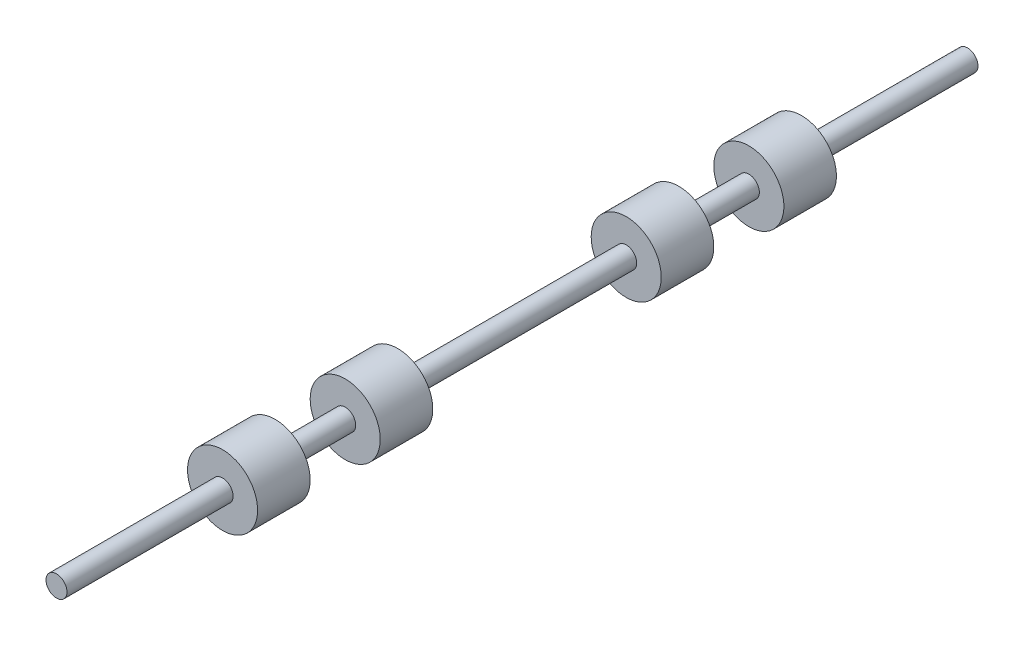
ISO-10303-21;
HEADER;
FILE_DESCRIPTION(('STEP AP214'),'2;1');
FILE_NAME('part.step','',(''),(''),'','','');
FILE_SCHEMA(('AUTOMOTIVE_DESIGN { 1 0 10303 214 1 1 1 1 }'));
ENDSEC;
DATA;
#1=APPLICATION_CONTEXT('core data for automotive mechanical design processes');
#2=APPLICATION_PROTOCOL_DEFINITION('international standard','automotive_design',2000,#1);
#3=PRODUCT_CONTEXT('',#1,'mechanical');
#4=PRODUCT('Part','Part','',(#3));
#5=PRODUCT_RELATED_PRODUCT_CATEGORY('part','',(#4));
#6=PRODUCT_DEFINITION_FORMATION('','',#4);
#7=PRODUCT_DEFINITION_CONTEXT('part definition',#1,'design');
#8=PRODUCT_DEFINITION('design','',#6,#7);
#9=PRODUCT_DEFINITION_SHAPE('','',#8);
#10=(LENGTH_UNIT() NAMED_UNIT(*) SI_UNIT(.MILLI.,.METRE.));
#11=(NAMED_UNIT(*) PLANE_ANGLE_UNIT() SI_UNIT($,.RADIAN.));
#12=(NAMED_UNIT(*) SI_UNIT($,.STERADIAN.) SOLID_ANGLE_UNIT());
#13=UNCERTAINTY_MEASURE_WITH_UNIT(LENGTH_MEASURE(1.E-05),#10,'distance_accuracy_value','');
#14=(GEOMETRIC_REPRESENTATION_CONTEXT(3) GLOBAL_UNCERTAINTY_ASSIGNED_CONTEXT((#13)) GLOBAL_UNIT_ASSIGNED_CONTEXT((#10,
#11,#12)) REPRESENTATION_CONTEXT('',''));
#15=CARTESIAN_POINT('',(0.,0.,0.));
#16=DIRECTION('',(0.,0.,1.));
#17=DIRECTION('',(1.,0.,0.));
#18=AXIS2_PLACEMENT_3D('',#15,#16,#17);
#19=CARTESIAN_POINT('',(0.,0.,16.26));
#20=DIRECTION('',(0.,0.,1.));
#21=DIRECTION('',(1.,0.,0.));
#22=AXIS2_PLACEMENT_3D('',#19,#20,#21);
#23=PLANE('',#22);
#24=CARTESIAN_POINT('',(0.,0.,16.26));
#25=DIRECTION('',(0.,0.,-1.));
#26=DIRECTION('',(-1.,0.,0.));
#27=AXIS2_PLACEMENT_3D('',#24,#25,#26);
#28=CIRCLE('',#27,1.);
#29=CARTESIAN_POINT('',(-1.,0.,16.26));
#30=VERTEX_POINT('',#29);
#31=EDGE_CURVE('E11',#30,#30,#28,.T.);
#32=ORIENTED_EDGE('',*,*,#31,.T.);
#33=EDGE_LOOP('',(#32));
#34=FACE_BOUND('',#33,.T.);
#35=ADVANCED_FACE('F44',(#34),#23,.F.);
#36=CARTESIAN_POINT('',(0.,0.,0.));
#37=DIRECTION('',(0.,0.,-1.));
#38=DIRECTION('',(-1.,0.,0.));
#39=AXIS2_PLACEMENT_3D('',#36,#37,#38);
#40=CYLINDRICAL_SURFACE('',#39,1.);
#41=ORIENTED_EDGE('',*,*,#31,.F.);
#42=EDGE_LOOP('',(#41));
#43=FACE_BOUND('',#42,.T.);
#44=CARTESIAN_POINT('',(0.,0.,17.76));
#45=DIRECTION('',(0.,0.,-1.));
#46=DIRECTION('',(-1.,0.,0.));
#47=AXIS2_PLACEMENT_3D('',#44,#45,#46);
#48=CIRCLE('',#47,1.);
#49=CARTESIAN_POINT('',(-1.,0.,17.76));
#50=VERTEX_POINT('',#49);
#51=EDGE_CURVE('E50',#50,#50,#48,.T.);
#52=ORIENTED_EDGE('',*,*,#51,.T.);
#53=EDGE_LOOP('',(#52));
#54=FACE_BOUND('',#53,.T.);
#55=ADVANCED_FACE('F56',(#43,#54),#40,.T.);
#56=CARTESIAN_POINT('',(0.,0.,17.76));
#57=DIRECTION('',(0.,0.,-1.));
#58=DIRECTION('',(-1.,0.,0.));
#59=AXIS2_PLACEMENT_3D('',#56,#57,#58);
#60=PLANE('',#59);
#61=ORIENTED_EDGE('',*,*,#51,.F.);
#62=EDGE_LOOP('',(#61));
#63=FACE_BOUND('',#62,.T.);
#64=ADVANCED_FACE('F58',(#63),#60,.F.);
#65=CLOSED_SHELL('',(#35,#55,#64));
#66=MANIFOLD_SOLID_BREP('B2',#65);
#67=CARTESIAN_POINT('',(0.,0.,19.76));
#68=DIRECTION('',(0.,0.,1.));
#69=DIRECTION('',(1.,0.,0.));
#70=AXIS2_PLACEMENT_3D('',#67,#68,#69);
#71=PLANE('',#70);
#72=CARTESIAN_POINT('',(0.,0.,19.76));
#73=DIRECTION('',(0.,0.,-1.));
#74=DIRECTION('',(-1.,0.,0.));
#75=AXIS2_PLACEMENT_3D('',#72,#73,#74);
#76=CIRCLE('',#75,1.);
#77=CARTESIAN_POINT('',(-1.,0.,19.76));
#78=VERTEX_POINT('',#77);
#79=EDGE_CURVE('E43',#78,#78,#76,.T.);
#80=ORIENTED_EDGE('',*,*,#79,.T.);
#81=EDGE_LOOP('',(#80));
#82=FACE_BOUND('',#81,.T.);
#83=ADVANCED_FACE('F99',(#82),#71,.F.);
#84=CARTESIAN_POINT('',(0.,0.,0.));
#85=DIRECTION('',(0.,0.,-1.));
#86=DIRECTION('',(-1.,0.,0.));
#87=AXIS2_PLACEMENT_3D('',#84,#85,#86);
#88=CYLINDRICAL_SURFACE('',#87,1.);
#89=ORIENTED_EDGE('',*,*,#79,.F.);
#90=EDGE_LOOP('',(#89));
#91=FACE_BOUND('',#90,.T.);
#92=CARTESIAN_POINT('',(0.,0.,21.26));
#93=DIRECTION('',(0.,0.,-1.));
#94=DIRECTION('',(-1.,0.,0.));
#95=AXIS2_PLACEMENT_3D('',#92,#93,#94);
#96=CIRCLE('',#95,1.);
#97=CARTESIAN_POINT('',(-1.,0.,21.26));
#98=VERTEX_POINT('',#97);
#99=EDGE_CURVE('E105',#98,#98,#96,.T.);
#100=ORIENTED_EDGE('',*,*,#99,.T.);
#101=EDGE_LOOP('',(#100));
#102=FACE_BOUND('',#101,.T.);
#103=ADVANCED_FACE('F111',(#91,#102),#88,.T.);
#104=CARTESIAN_POINT('',(0.,0.,21.26));
#105=DIRECTION('',(0.,0.,-1.));
#106=DIRECTION('',(-1.,0.,0.));
#107=AXIS2_PLACEMENT_3D('',#104,#105,#106);
#108=PLANE('',#107);
#109=ORIENTED_EDGE('',*,*,#99,.F.);
#110=EDGE_LOOP('',(#109));
#111=FACE_BOUND('',#110,.T.);
#112=ADVANCED_FACE('F113',(#111),#108,.F.);
#113=CLOSED_SHELL('',(#83,#103,#112));
#114=MANIFOLD_SOLID_BREP('B6',#113);
#115=CARTESIAN_POINT('',(0.,0.,9.74));
#116=DIRECTION('',(0.,0.,-1.));
#117=DIRECTION('',(-1.,0.,0.));
#118=AXIS2_PLACEMENT_3D('',#115,#116,#117);
#119=PLANE('',#118);
#120=CARTESIAN_POINT('',(0.,0.,9.74));
#121=DIRECTION('',(0.,0.,-1.));
#122=DIRECTION('',(-1.,0.,0.));
#123=AXIS2_PLACEMENT_3D('',#120,#121,#122);
#124=CIRCLE('',#123,1.);
#125=CARTESIAN_POINT('',(-1.,0.,9.74));
#126=VERTEX_POINT('',#125);
#127=EDGE_CURVE('E98',#126,#126,#124,.T.);
#128=ORIENTED_EDGE('',*,*,#127,.F.);
#129=EDGE_LOOP('',(#128));
#130=FACE_BOUND('',#129,.T.);
#131=ADVANCED_FACE('F154',(#130),#119,.F.);
#132=CARTESIAN_POINT('',(0.,0.,0.));
#133=DIRECTION('',(0.,0.,-1.));
#134=DIRECTION('',(-1.,0.,0.));
#135=AXIS2_PLACEMENT_3D('',#132,#133,#134);
#136=CYLINDRICAL_SURFACE('',#135,1.);
#137=CARTESIAN_POINT('',(0.,0.,8.24));
#138=DIRECTION('',(0.,0.,-1.));
#139=DIRECTION('',(-1.,0.,0.));
#140=AXIS2_PLACEMENT_3D('',#137,#138,#139);
#141=CIRCLE('',#140,1.);
#142=CARTESIAN_POINT('',(-1.,0.,8.24));
#143=VERTEX_POINT('',#142);
#144=EDGE_CURVE('E160',#143,#143,#141,.T.);
#145=ORIENTED_EDGE('',*,*,#144,.F.);
#146=EDGE_LOOP('',(#145));
#147=FACE_BOUND('',#146,.T.);
#148=ORIENTED_EDGE('',*,*,#127,.T.);
#149=EDGE_LOOP('',(#148));
#150=FACE_BOUND('',#149,.T.);
#151=ADVANCED_FACE('F168',(#147,#150),#136,.T.);
#152=CARTESIAN_POINT('',(0.,0.,8.24));
#153=DIRECTION('',(0.,0.,1.));
#154=DIRECTION('',(1.,0.,0.));
#155=AXIS2_PLACEMENT_3D('',#152,#153,#154);
#156=PLANE('',#155);
#157=ORIENTED_EDGE('',*,*,#144,.T.);
#158=EDGE_LOOP('',(#157));
#159=FACE_BOUND('',#158,.T.);
#160=ADVANCED_FACE('F166',(#159),#156,.F.);
#161=CLOSED_SHELL('',(#131,#151,#160));
#162=MANIFOLD_SOLID_BREP('B38',#161);
#163=CARTESIAN_POINT('',(0.,0.,6.24));
#164=DIRECTION('',(0.,0.,-1.));
#165=DIRECTION('',(-1.,0.,0.));
#166=AXIS2_PLACEMENT_3D('',#163,#164,#165);
#167=PLANE('',#166);
#168=CARTESIAN_POINT('',(0.,0.,6.24));
#169=DIRECTION('',(0.,0.,-1.));
#170=DIRECTION('',(-1.,0.,0.));
#171=AXIS2_PLACEMENT_3D('',#168,#169,#170);
#172=CIRCLE('',#171,1.);
#173=CARTESIAN_POINT('',(-1.,0.,6.24));
#174=VERTEX_POINT('',#173);
#175=EDGE_CURVE('E153',#174,#174,#172,.T.);
#176=ORIENTED_EDGE('',*,*,#175,.F.);
#177=EDGE_LOOP('',(#176));
#178=FACE_BOUND('',#177,.T.);
#179=ADVANCED_FACE('F208',(#178),#167,.F.);
#180=CARTESIAN_POINT('',(0.,0.,0.));
#181=DIRECTION('',(0.,0.,-1.));
#182=DIRECTION('',(-1.,0.,0.));
#183=AXIS2_PLACEMENT_3D('',#180,#181,#182);
#184=CYLINDRICAL_SURFACE('',#183,1.);
#185=CARTESIAN_POINT('',(0.,0.,4.74));
#186=DIRECTION('',(0.,0.,-1.));
#187=DIRECTION('',(-1.,0.,0.));
#188=AXIS2_PLACEMENT_3D('',#185,#186,#187);
#189=CIRCLE('',#188,1.);
#190=CARTESIAN_POINT('',(-1.,0.,4.74));
#191=VERTEX_POINT('',#190);
#192=EDGE_CURVE('E214',#191,#191,#189,.T.);
#193=ORIENTED_EDGE('',*,*,#192,.F.);
#194=EDGE_LOOP('',(#193));
#195=FACE_BOUND('',#194,.T.);
#196=ORIENTED_EDGE('',*,*,#175,.T.);
#197=EDGE_LOOP('',(#196));
#198=FACE_BOUND('',#197,.T.);
#199=ADVANCED_FACE('F222',(#195,#198),#184,.T.);
#200=CARTESIAN_POINT('',(0.,0.,4.74));
#201=DIRECTION('',(0.,0.,1.));
#202=DIRECTION('',(1.,0.,0.));
#203=AXIS2_PLACEMENT_3D('',#200,#201,#202);
#204=PLANE('',#203);
#205=ORIENTED_EDGE('',*,*,#192,.T.);
#206=EDGE_LOOP('',(#205));
#207=FACE_BOUND('',#206,.T.);
#208=ADVANCED_FACE('F220',(#207),#204,.F.);
#209=CLOSED_SHELL('',(#179,#199,#208));
#210=MANIFOLD_SOLID_BREP('B93',#209);
#211=CARTESIAN_POINT('',(0.,0.,26.));
#212=DIRECTION('',(0.,0.,-1.));
#213=DIRECTION('',(-1.,0.,0.));
#214=AXIS2_PLACEMENT_3D('',#211,#212,#213);
#215=CYLINDRICAL_SURFACE('',#214,0.3);
#216=CARTESIAN_POINT('',(0.,0.,26.));
#217=DIRECTION('',(0.,0.,1.));
#218=DIRECTION('',(1.,0.,0.));
#219=AXIS2_PLACEMENT_3D('',#216,#217,#218);
#220=CIRCLE('',#219,0.3);
#221=CARTESIAN_POINT('',(0.3,0.,26.));
#222=VERTEX_POINT('',#221);
#223=EDGE_CURVE('E207',#222,#222,#220,.T.);
#224=ORIENTED_EDGE('',*,*,#223,.F.);
#225=EDGE_LOOP('',(#224));
#226=FACE_BOUND('',#225,.T.);
#227=CARTESIAN_POINT('',(0.,0.,0.));
#228=DIRECTION('',(0.,0.,1.));
#229=DIRECTION('',(1.,0.,0.));
#230=AXIS2_PLACEMENT_3D('',#227,#228,#229);
#231=CIRCLE('',#230,0.3);
#232=CARTESIAN_POINT('',(0.3,0.,0.));
#233=VERTEX_POINT('',#232);
#234=EDGE_CURVE('E257',#233,#233,#231,.T.);
#235=ORIENTED_EDGE('',*,*,#234,.T.);
#236=EDGE_LOOP('',(#235));
#237=FACE_BOUND('',#236,.T.);
#238=ADVANCED_FACE('F254',(#226,#237),#215,.T.);
#239=CARTESIAN_POINT('',(0.,0.,26.));
#240=DIRECTION('',(0.,0.,1.));
#241=DIRECTION('',(1.,0.,0.));
#242=AXIS2_PLACEMENT_3D('',#239,#240,#241);
#243=PLANE('',#242);
#244=ORIENTED_EDGE('',*,*,#223,.T.);
#245=EDGE_LOOP('',(#244));
#246=FACE_BOUND('',#245,.T.);
#247=ADVANCED_FACE('F269',(#246),#243,.T.);
#248=CARTESIAN_POINT('',(0.,0.,0.));
#249=DIRECTION('',(0.,0.,1.));
#250=DIRECTION('',(1.,0.,0.));
#251=AXIS2_PLACEMENT_3D('',#248,#249,#250);
#252=PLANE('',#251);
#253=ORIENTED_EDGE('',*,*,#234,.F.);
#254=EDGE_LOOP('',(#253));
#255=FACE_BOUND('',#254,.T.);
#256=ADVANCED_FACE('F267',(#255),#252,.F.);
#257=CLOSED_SHELL('',(#238,#247,#256));
#258=MANIFOLD_SOLID_BREP('B148',#257);
#259=ADVANCED_BREP_SHAPE_REPRESENTATION('',(#18,#66,#114,#162,#210,#258),#14);
#260=SHAPE_DEFINITION_REPRESENTATION(#9,#259);
ENDSEC;
END-ISO-10303-21;
